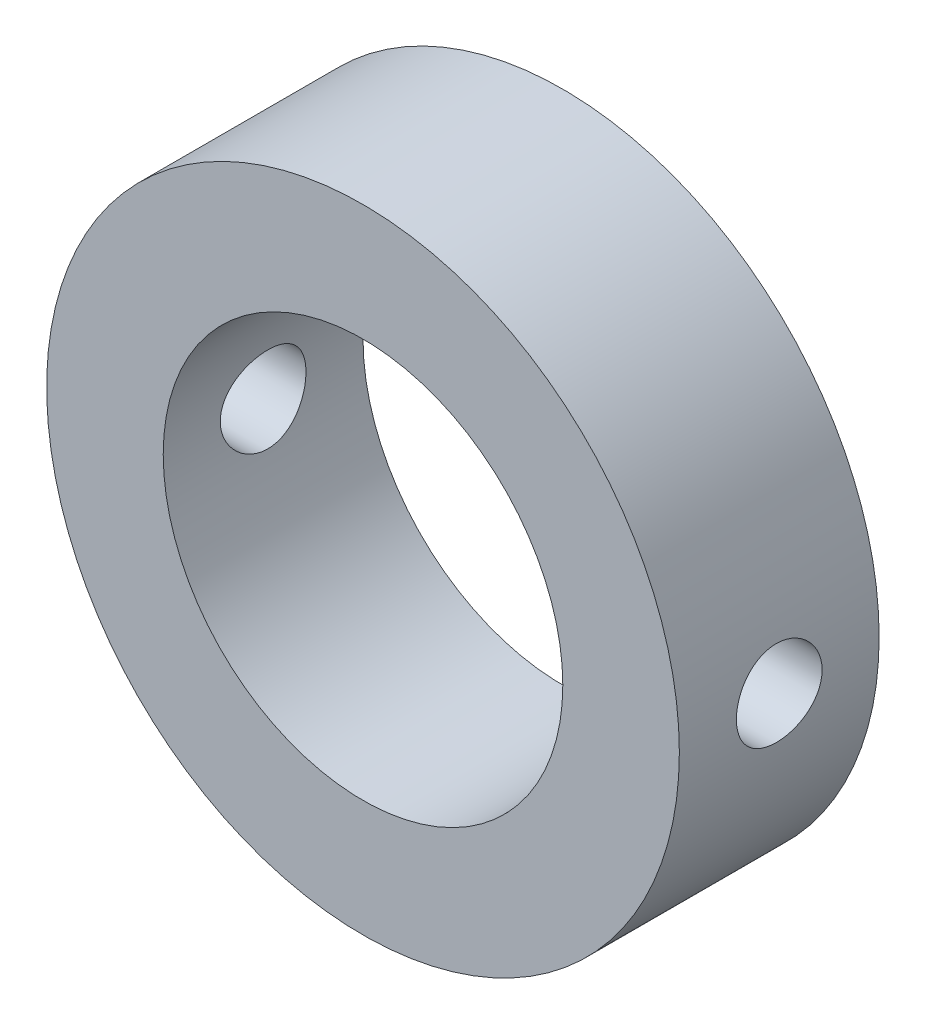
ISO-10303-21;
HEADER;
FILE_DESCRIPTION(('STEP AP214'),'2;1');
FILE_NAME('part.step','',(''),(''),'','','');
FILE_SCHEMA(('AUTOMOTIVE_DESIGN { 1 0 10303 214 1 1 1 1 }'));
ENDSEC;
DATA;
#1=APPLICATION_CONTEXT('core data for automotive mechanical design processes');
#2=APPLICATION_PROTOCOL_DEFINITION('international standard','automotive_design',2000,#1);
#3=PRODUCT_CONTEXT('',#1,'mechanical');
#4=PRODUCT('Part','Part','',(#3));
#5=PRODUCT_RELATED_PRODUCT_CATEGORY('part','',(#4));
#6=PRODUCT_DEFINITION_FORMATION('','',#4);
#7=PRODUCT_DEFINITION_CONTEXT('part definition',#1,'design');
#8=PRODUCT_DEFINITION('design','',#6,#7);
#9=PRODUCT_DEFINITION_SHAPE('','',#8);
#10=(LENGTH_UNIT() NAMED_UNIT(*) SI_UNIT(.MILLI.,.METRE.));
#11=(NAMED_UNIT(*) PLANE_ANGLE_UNIT() SI_UNIT($,.RADIAN.));
#12=(NAMED_UNIT(*) SI_UNIT($,.STERADIAN.) SOLID_ANGLE_UNIT());
#13=UNCERTAINTY_MEASURE_WITH_UNIT(LENGTH_MEASURE(1.E-05),#10,'distance_accuracy_value','');
#14=(GEOMETRIC_REPRESENTATION_CONTEXT(3) GLOBAL_UNCERTAINTY_ASSIGNED_CONTEXT((#13)) GLOBAL_UNIT_ASSIGNED_CONTEXT((#10,
#11,#12)) REPRESENTATION_CONTEXT('',''));
#15=CARTESIAN_POINT('',(0.,0.,0.));
#16=DIRECTION('',(0.,0.,1.));
#17=DIRECTION('',(1.,0.,0.));
#18=AXIS2_PLACEMENT_3D('',#15,#16,#17);
#19=CARTESIAN_POINT('',(0.,0.,6.));
#20=DIRECTION('',(0.,0.,1.));
#21=DIRECTION('',(1.,0.,0.));
#22=AXIS2_PLACEMENT_3D('',#19,#20,#21);
#23=PLANE('',#22);
#24=CARTESIAN_POINT('',(0.,0.,6.));
#25=DIRECTION('',(0.,0.,1.));
#26=DIRECTION('',(1.,0.,0.));
#27=AXIS2_PLACEMENT_3D('',#24,#25,#26);
#28=CIRCLE('',#27,19.);
#29=CARTESIAN_POINT('',(19.,0.,6.));
#30=VERTEX_POINT('',#29);
#31=EDGE_CURVE('E11',#30,#30,#28,.T.);
#32=ORIENTED_EDGE('',*,*,#31,.T.);
#33=EDGE_LOOP('',(#32));
#34=FACE_BOUND('',#33,.T.);
#35=CARTESIAN_POINT('',(0.,0.,6.));
#36=DIRECTION('',(0.,0.,1.));
#37=DIRECTION('',(1.,0.,0.));
#38=AXIS2_PLACEMENT_3D('',#35,#36,#37);
#39=CIRCLE('',#38,12.);
#40=CARTESIAN_POINT('',(12.,0.,6.));
#41=VERTEX_POINT('',#40);
#42=EDGE_CURVE('E55',#41,#41,#39,.T.);
#43=ORIENTED_EDGE('',*,*,#42,.F.);
#44=EDGE_LOOP('',(#43));
#45=FACE_BOUND('',#44,.T.);
#46=ADVANCED_FACE('F37',(#34,#45),#23,.T.);
#47=CARTESIAN_POINT('',(0.,0.,-6.));
#48=DIRECTION('',(0.,0.,1.));
#49=DIRECTION('',(1.,0.,0.));
#50=AXIS2_PLACEMENT_3D('',#47,#48,#49);
#51=PLANE('',#50);
#52=CARTESIAN_POINT('',(0.,0.,-6.));
#53=DIRECTION('',(0.,0.,1.));
#54=DIRECTION('',(1.,0.,0.));
#55=AXIS2_PLACEMENT_3D('',#52,#53,#54);
#56=CIRCLE('',#55,19.);
#57=CARTESIAN_POINT('',(19.,0.,-6.));
#58=VERTEX_POINT('',#57);
#59=EDGE_CURVE('E50',#58,#58,#56,.T.);
#60=ORIENTED_EDGE('',*,*,#59,.F.);
#61=EDGE_LOOP('',(#60));
#62=FACE_BOUND('',#61,.T.);
#63=CARTESIAN_POINT('',(0.,0.,-6.));
#64=DIRECTION('',(0.,0.,1.));
#65=DIRECTION('',(1.,0.,0.));
#66=AXIS2_PLACEMENT_3D('',#63,#64,#65);
#67=CIRCLE('',#66,12.);
#68=CARTESIAN_POINT('',(12.,0.,-6.));
#69=VERTEX_POINT('',#68);
#70=EDGE_CURVE('E58',#69,#69,#67,.T.);
#71=ORIENTED_EDGE('',*,*,#70,.T.);
#72=EDGE_LOOP('',(#71));
#73=FACE_BOUND('',#72,.T.);
#74=ADVANCED_FACE('F91',(#62,#73),#51,.F.);
#75=CARTESIAN_POINT('',(0.,0.,6.));
#76=DIRECTION('',(0.,0.,-1.));
#77=DIRECTION('',(-1.,0.,0.));
#78=AXIS2_PLACEMENT_3D('',#75,#76,#77);
#79=CYLINDRICAL_SURFACE('',#78,19.);
#80=CARTESIAN_POINT('',(-19.,0.,2.5748672517949));
#81=CARTESIAN_POINT('',(-18.9999978587735,-0.143923969748203,2.57486120413419));
#82=CARTESIAN_POINT('',(-18.9983474572848,-0.28793531915704,2.56275944983088));
#83=CARTESIAN_POINT('',(-18.9919224619895,-0.571943493597771,2.51467828472262));
#84=CARTESIAN_POINT('',(-18.9871446938618,-0.711936088669269,2.47867461260546));
#85=CARTESIAN_POINT('',(-18.9750026776924,-0.983754609274015,2.38387600762609));
#86=CARTESIAN_POINT('',(-18.9676402568268,-1.11558622682615,2.3250971722397));
#87=CARTESIAN_POINT('',(-18.9511456624555,-1.36749137987465,2.18645367592731));
#88=CARTESIAN_POINT('',(-18.9420137693904,-1.48756677406153,2.10659235560276));
#89=CARTESIAN_POINT('',(-18.9229325334773,-1.71334593087833,1.92750283151742));
#90=CARTESIAN_POINT('',(-18.9129787971465,-1.81896319562851,1.82816603625075));
#91=CARTESIAN_POINT('',(-18.8934107278206,-2.01208249813882,1.61317880986211));
#92=CARTESIAN_POINT('',(-18.8837964129998,-2.09958356709368,1.49752750684006));
#93=CARTESIAN_POINT('',(-18.8659528347985,-2.25431491658168,1.2526240831509));
#94=CARTESIAN_POINT('',(-18.8577292416595,-2.32146305525546,1.12331961598129));
#95=CARTESIAN_POINT('',(-18.8436570982998,-2.43305774829611,0.855138719761985));
#96=CARTESIAN_POINT('',(-18.837808442453,-2.47750531230144,0.716262716731018));
#97=CARTESIAN_POINT('',(-18.8291909182935,-2.542171874723,0.433783887354499));
#98=CARTESIAN_POINT('',(-18.8264033798546,-2.56253780910067,0.29021527805782));
#99=CARTESIAN_POINT('',(-18.8241667810873,-2.57891788010695,0.0016731484916192));
#100=CARTESIAN_POINT('',(-18.8247175636942,-2.57493316240916,-0.143300305360968));
#101=CARTESIAN_POINT('',(-18.8290782915061,-2.54284543942851,-0.429507306620112));
#102=CARTESIAN_POINT('',(-18.8328662681443,-2.51490500067209,-0.570759462505123));
#103=CARTESIAN_POINT('',(-18.8432402940148,-2.43595294004264,-0.846551762454316));
#104=CARTESIAN_POINT('',(-18.8498264089725,-2.38494077623625,-0.98109174877345));
#105=CARTESIAN_POINT('',(-18.8650792824393,-2.26112084637407,-1.2401414845771));
#106=CARTESIAN_POINT('',(-18.873752698595,-2.1882431507957,-1.36461740130712));
#107=CARTESIAN_POINT('',(-18.8921978979478,-2.02281082093172,-1.59963459623178));
#108=CARTESIAN_POINT('',(-18.901969740116,-1.93025512995681,-1.71017512560161));
#109=CARTESIAN_POINT('',(-18.9216081856101,-1.72719660335559,-1.91512674069767));
#110=CARTESIAN_POINT('',(-18.9314749127044,-1.61655378278395,-2.00939917796425));
#111=CARTESIAN_POINT('',(-18.9501171925647,-1.38094176822158,-2.17805659841931));
#112=CARTESIAN_POINT('',(-18.9588927420033,-1.2559725305467,-2.25244152096442));
#113=CARTESIAN_POINT('',(-18.9743707525648,-0.99514289013624,-2.3792152908875));
#114=CARTESIAN_POINT('',(-18.9810723194138,-0.859277820966149,-2.43159465322891));
#115=CARTESIAN_POINT('',(-18.991639462416,-0.580569371924114,-2.512756216085));
#116=CARTESIAN_POINT('',(-18.9955051947938,-0.437726376924526,-2.5415397164923));
#117=CARTESIAN_POINT('',(-18.9999446497919,-0.150314804578114,-2.57451093875323));
#118=CARTESIAN_POINT('',(-19.0005439145938,-0.00576849945893118,-2.57888950140809));
#119=CARTESIAN_POINT('',(-18.9984521026137,0.281996094586324,-2.56343135334194));
#120=CARTESIAN_POINT('',(-18.9957611085136,0.425214416792571,-2.54359525111885));
#121=CARTESIAN_POINT('',(-18.9874069892078,0.705688521492797,-2.48042946036537));
#122=CARTESIAN_POINT('',(-18.9817554786541,0.842965351061264,-2.43719155955738));
#123=CARTESIAN_POINT('',(-18.9681125627188,1.10832028867046,-2.32854550933412));
#124=CARTESIAN_POINT('',(-18.9601210654237,1.23639803513013,-2.26313648903354));
#125=CARTESIAN_POINT('',(-18.9426242958455,1.48056623833795,-2.1115487953933));
#126=CARTESIAN_POINT('',(-18.9331102120467,1.59658000256925,-2.02524762544825));
#127=CARTESIAN_POINT('',(-18.9136580480606,1.81254485252579,-1.83449759671461));
#128=CARTESIAN_POINT('',(-18.9037199479764,1.91249518342657,-1.73004788560153));
#129=CARTESIAN_POINT('',(-18.8844601454209,2.09417998691368,-1.50512142266927));
#130=CARTESIAN_POINT('',(-18.8751430401039,2.17578737433721,-1.38454156556202));
#131=CARTESIAN_POINT('',(-18.858258116911,2.31758965698397,-1.13127406995856));
#132=CARTESIAN_POINT('',(-18.8506902589106,2.37778504337557,-0.998586709283247));
#133=CARTESIAN_POINT('',(-18.8381928557696,2.47485233111111,-0.725268321381649));
#134=CARTESIAN_POINT('',(-18.8332554286458,2.51179397248245,-0.584662437866878));
#135=CARTESIAN_POINT('',(-18.8265559978761,2.56152874183622,-0.299171310144739));
#136=CARTESIAN_POINT('',(-18.8247938182955,2.5743232077726,-0.154286303488134));
#137=CARTESIAN_POINT('',(-18.8246501251889,2.57537297540954,0.134385131292231));
#138=CARTESIAN_POINT('',(-18.8262410987832,2.56382798400318,0.278170859926122));
#139=CARTESIAN_POINT('',(-18.832565043889,2.51695147836871,0.561737178020952));
#140=CARTESIAN_POINT('',(-18.8372980137826,2.48161997638933,0.701517769544274));
#141=CARTESIAN_POINT('',(-18.8493637118999,2.388239158248,0.97306799109805));
#142=CARTESIAN_POINT('',(-18.8566951387502,2.33020121254266,1.1048415926039));
#143=CARTESIAN_POINT('',(-18.8731335873505,2.19307462780149,1.35681255241822));
#144=CARTESIAN_POINT('',(-18.8822406466418,2.11398554367814,1.47700966589001));
#145=CARTESIAN_POINT('',(-18.9012935595498,1.93626667412728,1.7034342812611));
#146=CARTESIAN_POINT('',(-18.9112454369671,1.83748835563555,1.80954470426853));
#147=CARTESIAN_POINT('',(-18.9308146075773,1.6235073932625,2.00375752393124));
#148=CARTESIAN_POINT('',(-18.9404318218351,1.50830090679473,2.09185569571281));
#149=CARTESIAN_POINT('',(-18.9582962555726,1.26413670373261,2.24788572832148));
#150=CARTESIAN_POINT('',(-18.9665371680476,1.13511989999819,2.31572581545581));
#151=CARTESIAN_POINT('',(-18.9806576315467,0.867480160792979,2.42867704742829));
#152=CARTESIAN_POINT('',(-18.9865396993645,0.72886764979004,2.47381243044086));
#153=CARTESIAN_POINT('',(-18.9938916056808,0.491312154289936,2.52949268550329));
#154=CARTESIAN_POINT('',(-18.9961708550266,0.393855349203831,2.54648308387137));
#155=CARTESIAN_POINT('',(-18.9992257803905,0.197612754489461,2.56917239121501));
#156=CARTESIAN_POINT('',(-19.0000014702967,0.0988269771452289,2.57487140448766));
#157=CARTESIAN_POINT('',(-19.,0.,2.5748672517949));
#158=B_SPLINE_CURVE_WITH_KNOTS('',3,(#80,#81,#82,#83,#84,#85,#86,#87,#88,#89,#90,#91,#92,#93,
#94,#95,#96,#97,#98,#99,#100,#101,#102,#103,#104,#105,#106,#107,#108,#109,#110,#111,#112,#113,
#114,#115,#116,#117,#118,#119,#120,#121,#122,#123,#124,#125,#126,#127,#128,#129,#130,#131,#132,
#133,#134,#135,#136,#137,#138,#139,#140,#141,#142,#143,#144,#145,#146,#147,#148,#149,#150,#151,
#152,#153,#154,#155,#156,#157),.UNSPECIFIED.,.T.,.F.,(4,2,2,2,2,2,2,2,2,2,2,2,2,2,2,2,2,2,2,2,2,
2,2,2,2,2,2,2,2,2,2,2,2,2,2,2,2,2,4),(0.,0.431410870726488,0.863260310008801,1.2948050734381,
1.72628149792795,2.16023592623585,2.59421355526482,3.02992003110206,3.46560712662233,
3.89862189553513,4.3316162916971,4.76169538216481,5.19178457531527,5.62326419742605,
6.05476699542941,6.48978295825727,6.9248002475726,7.36000485009571,7.79518547564888,
8.22695826670017,8.65872020782072,9.0888008146694,9.51889831711462,9.95158142809168,
10.3842848650077,10.8198996305893,11.2555044029903,11.6897964547886,12.1240644424958,
12.5547831053274,12.9855015463631,13.4160045767518,13.8465167100569,14.2804086512464,
14.7144022477442,15.1503331030534,15.5857975919468,15.8820333486169,16.1782663689823),.UNSPECIFIED.);
#159=CARTESIAN_POINT('',(-19.,0.,2.5748672517949));
#160=VERTEX_POINT('',#159);
#161=EDGE_CURVE('E81',#160,#160,#158,.T.);
#162=ORIENTED_EDGE('',*,*,#161,.T.);
#163=EDGE_LOOP('',(#162));
#164=FACE_BOUND('',#163,.T.);
#165=CARTESIAN_POINT('',(19.,0.,-2.5748672517949));
#166=CARTESIAN_POINT('',(18.9999978587735,-0.143923969748203,-2.57486120413419));
#167=CARTESIAN_POINT('',(18.9983474572848,-0.28793531915704,-2.56275944983088));
#168=CARTESIAN_POINT('',(18.9919224619895,-0.571943493597771,-2.51467828472262));
#169=CARTESIAN_POINT('',(18.9871446938618,-0.711936088669269,-2.47867461260546));
#170=CARTESIAN_POINT('',(18.9750026776924,-0.983754609274015,-2.38387600762609));
#171=CARTESIAN_POINT('',(18.9676402568268,-1.11558622682615,-2.3250971722397));
#172=CARTESIAN_POINT('',(18.9511456624555,-1.36749137987465,-2.18645367592731));
#173=CARTESIAN_POINT('',(18.9420137693904,-1.48756677406153,-2.10659235560276));
#174=CARTESIAN_POINT('',(18.9229325334773,-1.71334593087833,-1.92750283151742));
#175=CARTESIAN_POINT('',(18.9129787971465,-1.81896319562851,-1.82816603625075));
#176=CARTESIAN_POINT('',(18.8934107278206,-2.01208249813882,-1.61317880986211));
#177=CARTESIAN_POINT('',(18.8837964129998,-2.09958356709368,-1.49752750684006));
#178=CARTESIAN_POINT('',(18.8659528347985,-2.25431491658168,-1.2526240831509));
#179=CARTESIAN_POINT('',(18.8577292416595,-2.32146305525546,-1.12331961598129));
#180=CARTESIAN_POINT('',(18.8436570982998,-2.43305774829611,-0.855138719761985));
#181=CARTESIAN_POINT('',(18.837808442453,-2.47750531230144,-0.716262716731018));
#182=CARTESIAN_POINT('',(18.8291909182935,-2.542171874723,-0.433783887354499));
#183=CARTESIAN_POINT('',(18.8264033798546,-2.56253780910067,-0.29021527805782));
#184=CARTESIAN_POINT('',(18.8241667810873,-2.57891788010695,-0.0016731484916192));
#185=CARTESIAN_POINT('',(18.8247175636942,-2.57493316240916,0.143300305360968));
#186=CARTESIAN_POINT('',(18.8290782915061,-2.54284543942851,0.429507306620112));
#187=CARTESIAN_POINT('',(18.8328662681443,-2.51490500067209,0.570759462505123));
#188=CARTESIAN_POINT('',(18.8432402940148,-2.43595294004264,0.846551762454316));
#189=CARTESIAN_POINT('',(18.8498264089725,-2.38494077623625,0.98109174877345));
#190=CARTESIAN_POINT('',(18.8650792824393,-2.26112084637407,1.2401414845771));
#191=CARTESIAN_POINT('',(18.873752698595,-2.1882431507957,1.36461740130712));
#192=CARTESIAN_POINT('',(18.8921978979478,-2.02281082093172,1.59963459623178));
#193=CARTESIAN_POINT('',(18.901969740116,-1.93025512995681,1.71017512560161));
#194=CARTESIAN_POINT('',(18.9216081856101,-1.72719660335559,1.91512674069767));
#195=CARTESIAN_POINT('',(18.9314749127044,-1.61655378278395,2.00939917796425));
#196=CARTESIAN_POINT('',(18.9501171925647,-1.38094176822158,2.17805659841931));
#197=CARTESIAN_POINT('',(18.9588927420033,-1.2559725305467,2.25244152096442));
#198=CARTESIAN_POINT('',(18.9743707525648,-0.99514289013624,2.3792152908875));
#199=CARTESIAN_POINT('',(18.9810723194138,-0.859277820966149,2.43159465322891));
#200=CARTESIAN_POINT('',(18.991639462416,-0.580569371924114,2.512756216085));
#201=CARTESIAN_POINT('',(18.9955051947938,-0.437726376924526,2.5415397164923));
#202=CARTESIAN_POINT('',(18.9999446497919,-0.150314804578114,2.57451093875323));
#203=CARTESIAN_POINT('',(19.0005439145938,-0.00576849945893118,2.57888950140809));
#204=CARTESIAN_POINT('',(18.9984521026137,0.281996094586324,2.56343135334194));
#205=CARTESIAN_POINT('',(18.9957611085136,0.425214416792571,2.54359525111885));
#206=CARTESIAN_POINT('',(18.9874069892078,0.705688521492797,2.48042946036537));
#207=CARTESIAN_POINT('',(18.9817554786541,0.842965351061264,2.43719155955738));
#208=CARTESIAN_POINT('',(18.9681125627188,1.10832028867046,2.32854550933412));
#209=CARTESIAN_POINT('',(18.9601210654237,1.23639803513013,2.26313648903354));
#210=CARTESIAN_POINT('',(18.9426242958455,1.48056623833795,2.1115487953933));
#211=CARTESIAN_POINT('',(18.9331102120467,1.59658000256925,2.02524762544825));
#212=CARTESIAN_POINT('',(18.9136580480606,1.81254485252579,1.83449759671461));
#213=CARTESIAN_POINT('',(18.9037199479764,1.91249518342657,1.73004788560153));
#214=CARTESIAN_POINT('',(18.8844601454209,2.09417998691368,1.50512142266927));
#215=CARTESIAN_POINT('',(18.8751430401039,2.17578737433721,1.38454156556202));
#216=CARTESIAN_POINT('',(18.858258116911,2.31758965698397,1.13127406995856));
#217=CARTESIAN_POINT('',(18.8506902589106,2.37778504337557,0.998586709283247));
#218=CARTESIAN_POINT('',(18.8381928557696,2.47485233111111,0.725268321381649));
#219=CARTESIAN_POINT('',(18.8332554286458,2.51179397248245,0.584662437866878));
#220=CARTESIAN_POINT('',(18.8265559978761,2.56152874183622,0.299171310144739));
#221=CARTESIAN_POINT('',(18.8247938182955,2.5743232077726,0.154286303488134));
#222=CARTESIAN_POINT('',(18.8246501251889,2.57537297540954,-0.134385131292231));
#223=CARTESIAN_POINT('',(18.8262410987832,2.56382798400318,-0.278170859926122));
#224=CARTESIAN_POINT('',(18.832565043889,2.51695147836871,-0.561737178020952));
#225=CARTESIAN_POINT('',(18.8372980137826,2.48161997638933,-0.701517769544274));
#226=CARTESIAN_POINT('',(18.8493637118999,2.388239158248,-0.97306799109805));
#227=CARTESIAN_POINT('',(18.8566951387502,2.33020121254266,-1.1048415926039));
#228=CARTESIAN_POINT('',(18.8731335873505,2.19307462780149,-1.35681255241822));
#229=CARTESIAN_POINT('',(18.8822406466418,2.11398554367814,-1.47700966589001));
#230=CARTESIAN_POINT('',(18.9012935595498,1.93626667412728,-1.7034342812611));
#231=CARTESIAN_POINT('',(18.9112454369671,1.83748835563555,-1.80954470426853));
#232=CARTESIAN_POINT('',(18.9308146075773,1.6235073932625,-2.00375752393124));
#233=CARTESIAN_POINT('',(18.9404318218351,1.50830090679473,-2.09185569571281));
#234=CARTESIAN_POINT('',(18.9582962555726,1.26413670373261,-2.24788572832148));
#235=CARTESIAN_POINT('',(18.9665371680476,1.13511989999819,-2.31572581545581));
#236=CARTESIAN_POINT('',(18.9806576315467,0.867480160792979,-2.42867704742829));
#237=CARTESIAN_POINT('',(18.9865396993645,0.72886764979004,-2.47381243044086));
#238=CARTESIAN_POINT('',(18.9938916056808,0.491312154289936,-2.52949268550329));
#239=CARTESIAN_POINT('',(18.9961708550266,0.393855349203831,-2.54648308387137));
#240=CARTESIAN_POINT('',(18.9992257803905,0.197612754489461,-2.56917239121501));
#241=CARTESIAN_POINT('',(19.0000014702967,0.0988269771452289,-2.57487140448766));
#242=CARTESIAN_POINT('',(19.,0.,-2.5748672517949));
#243=B_SPLINE_CURVE_WITH_KNOTS('',3,(#165,#166,#167,#168,#169,#170,#171,#172,#173,#174,#175,
#176,#177,#178,#179,#180,#181,#182,#183,#184,#185,#186,#187,#188,#189,#190,#191,#192,#193,#194,
#195,#196,#197,#198,#199,#200,#201,#202,#203,#204,#205,#206,#207,#208,#209,#210,#211,#212,#213,
#214,#215,#216,#217,#218,#219,#220,#221,#222,#223,#224,#225,#226,#227,#228,#229,#230,#231,#232,
#233,#234,#235,#236,#237,#238,#239,#240,#241,#242),.UNSPECIFIED.,.T.,.F.,(4,2,2,2,2,2,2,2,2,2,2,
2,2,2,2,2,2,2,2,2,2,2,2,2,2,2,2,2,2,2,2,2,2,2,2,2,2,2,4),(0.,0.431410870726488,
0.863260310008801,1.2948050734381,1.72628149792795,2.16023592623585,2.59421355526482,
3.02992003110206,3.46560712662233,3.89862189553513,4.3316162916971,4.76169538216481,
5.19178457531527,5.62326419742605,6.05476699542941,6.48978295825727,6.9248002475726,
7.36000485009571,7.79518547564888,8.22695826670017,8.65872020782072,9.0888008146694,
9.51889831711462,9.95158142809168,10.3842848650077,10.8198996305893,11.2555044029903,
11.6897964547886,12.1240644424958,12.5547831053274,12.9855015463631,13.4160045767518,
13.8465167100569,14.2804086512464,14.7144022477442,15.1503331030534,15.5857975919468,
15.8820333486169,16.1782663689823),.UNSPECIFIED.);
#244=CARTESIAN_POINT('',(19.,0.,-2.5748672517949));
#245=VERTEX_POINT('',#244);
#246=EDGE_CURVE('E77',#245,#245,#243,.T.);
#247=ORIENTED_EDGE('',*,*,#246,.T.);
#248=EDGE_LOOP('',(#247));
#249=FACE_BOUND('',#248,.T.);
#250=ORIENTED_EDGE('',*,*,#31,.F.);
#251=EDGE_LOOP('',(#250));
#252=FACE_BOUND('',#251,.T.);
#253=ORIENTED_EDGE('',*,*,#59,.T.);
#254=EDGE_LOOP('',(#253));
#255=FACE_BOUND('',#254,.T.);
#256=ADVANCED_FACE('F39',(#164,#249,#252,#255),#79,.T.);
#257=CARTESIAN_POINT('',(0.,0.,6.));
#258=DIRECTION('',(0.,0.,-1.));
#259=DIRECTION('',(-1.,0.,0.));
#260=AXIS2_PLACEMENT_3D('',#257,#258,#259);
#261=CYLINDRICAL_SURFACE('',#260,12.);
#262=CARTESIAN_POINT('',(-12.,0.,2.5748672517949));
#263=CARTESIAN_POINT('',(-11.9999973576132,-0.142876300092718,2.57486228075665));
#264=CARTESIAN_POINT('',(-11.9974223057735,-0.285813287746784,2.56293504237487));
#265=CARTESIAN_POINT('',(-11.9873985541302,-0.5676317219688,2.51558808042176));
#266=CARTESIAN_POINT('',(-11.979946282609,-0.706510118398592,2.4801511398103));
#267=CARTESIAN_POINT('',(-11.960998394885,-0.976097367421056,2.38694219533704));
#268=CARTESIAN_POINT('',(-11.9495069235768,-1.10681443358199,2.3291930814943));
#269=CARTESIAN_POINT('',(-11.9237229391836,-1.35669848886414,2.19307068105082));
#270=CARTESIAN_POINT('',(-11.9094305199667,-1.47586586485003,2.11469808557443));
#271=CARTESIAN_POINT('',(-11.8793647232776,-1.70111758230694,1.93826940528698));
#272=CARTESIAN_POINT('',(-11.8635735561595,-1.8069975629378,1.83995541522628));
#273=CARTESIAN_POINT('',(-11.8324162973609,-2.00089750850499,1.62698856798923));
#274=CARTESIAN_POINT('',(-11.8170502425584,-2.08891592814181,1.51233429858711));
#275=CARTESIAN_POINT('',(-11.788308016294,-2.2454886044116,1.26843988269888));
#276=CARTESIAN_POINT('',(-11.7749546626224,-2.3138266650117,1.13905801635895));
#277=CARTESIAN_POINT('',(-11.7520045026072,-2.42771237471952,0.870313276763276));
#278=CARTESIAN_POINT('',(-11.7424072652329,-2.47326263899366,0.730951550912614));
#279=CARTESIAN_POINT('',(-11.7282368897807,-2.53960708442058,0.448415828816712));
#280=CARTESIAN_POINT('',(-11.7235905503695,-2.5607623541706,0.305330371703388));
#281=CARTESIAN_POINT('',(-11.7196280906188,-2.57883878117809,0.0175715145571115));
#282=CARTESIAN_POINT('',(-11.7203113405836,-2.57576280137974,-0.127101695864395));
#283=CARTESIAN_POINT('',(-11.7268645345774,-2.54575493936893,-0.411254751793798));
#284=CARTESIAN_POINT('',(-11.7326435520999,-2.51924124804787,-0.550781173761041));
#285=CARTESIAN_POINT('',(-11.7485935080235,-2.44377257048763,-0.823358300549573));
#286=CARTESIAN_POINT('',(-11.7587646844886,-2.39481636781034,-0.95640865391989));
#287=CARTESIAN_POINT('',(-11.7824432928785,-2.27546487502224,-1.21343921714571));
#288=CARTESIAN_POINT('',(-11.795975772921,-2.20490765376292,-1.33734183120419));
#289=CARTESIAN_POINT('',(-11.8248366947276,-2.0444709328802,-1.57170390344844));
#290=CARTESIAN_POINT('',(-11.8401653724401,-1.95458889345321,-1.68216159161609));
#291=CARTESIAN_POINT('',(-11.8712825357975,-1.7558344546648,-1.88890724143933));
#292=CARTESIAN_POINT('',(-11.8870739560159,-1.64660614564281,-1.98485293441652));
#293=CARTESIAN_POINT('',(-11.9170467784548,-1.41343242655769,-2.15711874512395));
#294=CARTESIAN_POINT('',(-11.9312281535982,-1.28948676905499,-2.23343853281982));
#295=CARTESIAN_POINT('',(-11.9564263727783,-1.02998757014741,-2.36436575998347));
#296=CARTESIAN_POINT('',(-11.9674368594919,-0.894411406962982,-2.41892966403614));
#297=CARTESIAN_POINT('',(-11.9850052639049,-0.615726446162512,-2.5044075297754));
#298=CARTESIAN_POINT('',(-11.9915638041774,-0.472618704801419,-2.5353247983526));
#299=CARTESIAN_POINT('',(-11.9994011684263,-0.185869990108955,-2.57213698118983));
#300=CARTESIAN_POINT('',(-12.0007786717414,-0.0422916826120492,-2.5784996308797));
#301=CARTESIAN_POINT('',(-11.9983747228325,0.243876265552569,-2.56728788063934));
#302=CARTESIAN_POINT('',(-11.994593606685,0.386465970018063,-2.54971504007129));
#303=CARTESIAN_POINT('',(-11.9823594243175,0.665068704841843,-2.49151917849018));
#304=CARTESIAN_POINT('',(-11.9739558598016,0.801135091894016,-2.45114026649297));
#305=CARTESIAN_POINT('',(-11.9534168818104,1.06456415772794,-2.34874845806935));
#306=CARTESIAN_POINT('',(-11.9412811587772,1.19192611346295,-2.28673376703999));
#307=CARTESIAN_POINT('',(-11.9143799694977,1.43627392711793,-2.14184770152795));
#308=CARTESIAN_POINT('',(-11.8995804840801,1.55309209883753,-2.05869998248465));
#309=CARTESIAN_POINT('',(-11.869065127489,1.77128540712584,-1.87427340370954));
#310=CARTESIAN_POINT('',(-11.8533491422518,1.87265861578247,-1.77299228390887));
#311=CARTESIAN_POINT('',(-11.8224330974892,2.05892361201565,-1.55303130222843));
#312=CARTESIAN_POINT('',(-11.8072470825072,2.14349212518895,-1.43407535474948));
#313=CARTESIAN_POINT('',(-11.7794286896512,2.29145162124804,-1.18337367506738));
#314=CARTESIAN_POINT('',(-11.7667962028163,2.3548435078302,-1.05162848894497));
#315=CARTESIAN_POINT('',(-11.7456327944972,2.45823061585169,-0.779787259510075));
#316=CARTESIAN_POINT('',(-11.7370792047102,2.498355418853,-0.639742350067642));
#317=CARTESIAN_POINT('',(-11.7249994279397,2.5544523454728,-0.354691738449937));
#318=CARTESIAN_POINT('',(-11.7214724716679,2.57042816493313,-0.209686798848835));
#319=CARTESIAN_POINT('',(-11.7198924695804,2.57762096705793,0.0779115163956855));
#320=CARTESIAN_POINT('',(-11.7217261924789,2.56935009166561,0.220491701839235));
#321=CARTESIAN_POINT('',(-11.7304055608149,2.52942586751873,0.502176393161912));
#322=CARTESIAN_POINT('',(-11.7372511517318,2.49777277312275,0.641280936833064));
#323=CARTESIAN_POINT('',(-11.7551287630134,2.4122258089094,0.911677389455271));
#324=CARTESIAN_POINT('',(-11.7661472487044,2.35840379447291,1.0429929856439));
#325=CARTESIAN_POINT('',(-11.7911349655818,2.23010954813046,1.29480742569407));
#326=CARTESIAN_POINT('',(-11.8051044907194,2.15563525883278,1.41530519029293));
#327=CARTESIAN_POINT('',(-11.834760405598,1.98644026360959,1.64459405017665));
#328=CARTESIAN_POINT('',(-11.8504749375733,1.89135343701567,1.75311139192779));
#329=CARTESIAN_POINT('',(-11.8816582628121,1.6843777817891,1.95281787200235));
#330=CARTESIAN_POINT('',(-11.8971269985416,1.57248508162296,2.04400300654751));
#331=CARTESIAN_POINT('',(-11.9263027227159,1.3334051657184,2.20753442713808));
#332=CARTESIAN_POINT('',(-11.9399855256862,1.20604572830692,2.27963347113249));
#333=CARTESIAN_POINT('',(-11.9638062402357,0.940751731581262,2.40128803795205));
#334=CARTESIAN_POINT('',(-11.9739471744204,0.802826312388977,2.45086279376994));
#335=CARTESIAN_POINT('',(-11.9876950406406,0.553935077006438,2.51704943472531));
#336=CARTESIAN_POINT('',(-11.9922811849619,0.444332757011566,2.53869038009735));
#337=CARTESIAN_POINT('',(-11.9984346344108,0.223165912975828,2.56760093387267));
#338=CARTESIAN_POINT('',(-12.0000020639829,0.111601470013491,2.57487113470043));
#339=CARTESIAN_POINT('',(-12.,0.,2.5748672517949));
#340=B_SPLINE_CURVE_WITH_KNOTS('',3,(#262,#263,#264,#265,#266,#267,#268,#269,#270,#271,#272,
#273,#274,#275,#276,#277,#278,#279,#280,#281,#282,#283,#284,#285,#286,#287,#288,#289,#290,#291,
#292,#293,#294,#295,#296,#297,#298,#299,#300,#301,#302,#303,#304,#305,#306,#307,#308,#309,#310,
#311,#312,#313,#314,#315,#316,#317,#318,#319,#320,#321,#322,#323,#324,#325,#326,#327,#328,#329,
#330,#331,#332,#333,#334,#335,#336,#337,#338,#339),.UNSPECIFIED.,.T.,.F.,(4,2,2,2,2,2,2,2,2,2,2,
2,2,2,2,2,2,2,2,2,2,2,2,2,2,2,2,2,2,2,2,2,2,2,2,2,2,2,4),(0.,0.428220448688281,
0.856754846024156,1.28485077304524,1.71293235574476,2.14695075349604,2.58100668451502,
3.0196633266728,3.45826961629062,3.89029688357524,4.32227310721107,4.74669388254395,
5.17113766522466,5.59884459258421,6.02660776659685,6.46326271408366,6.89992500399449,
7.33745675976648,7.77492731721956,8.20402223301896,8.63308919524927,9.05764830303358,
9.48224263470548,9.91270374059526,10.3432185346963,10.7813490224011,11.2194608108328,
11.6551085858868,12.0906896811841,12.5171371046002,12.9435798890653,13.3686512018044,
13.7937648756184,14.2271593045145,14.6606537271358,15.0995156669738,15.538002164763,
15.8725013207977,16.2069866870371),.UNSPECIFIED.);
#341=CARTESIAN_POINT('',(-12.,0.,2.5748672517949));
#342=VERTEX_POINT('',#341);
#343=EDGE_CURVE('E42',#342,#342,#340,.T.);
#344=ORIENTED_EDGE('',*,*,#343,.F.);
#345=EDGE_LOOP('',(#344));
#346=FACE_BOUND('',#345,.T.);
#347=CARTESIAN_POINT('',(12.,0.,-2.5748672517949));
#348=CARTESIAN_POINT('',(11.9999973576132,-0.142876300092718,-2.57486228075665));
#349=CARTESIAN_POINT('',(11.9974223057735,-0.285813287746784,-2.56293504237487));
#350=CARTESIAN_POINT('',(11.9873985541302,-0.5676317219688,-2.51558808042176));
#351=CARTESIAN_POINT('',(11.979946282609,-0.706510118398592,-2.4801511398103));
#352=CARTESIAN_POINT('',(11.960998394885,-0.976097367421056,-2.38694219533704));
#353=CARTESIAN_POINT('',(11.9495069235768,-1.10681443358199,-2.3291930814943));
#354=CARTESIAN_POINT('',(11.9237229391836,-1.35669848886414,-2.19307068105082));
#355=CARTESIAN_POINT('',(11.9094305199667,-1.47586586485003,-2.11469808557443));
#356=CARTESIAN_POINT('',(11.8793647232776,-1.70111758230694,-1.93826940528698));
#357=CARTESIAN_POINT('',(11.8635735561595,-1.8069975629378,-1.83995541522628));
#358=CARTESIAN_POINT('',(11.8324162973609,-2.00089750850499,-1.62698856798923));
#359=CARTESIAN_POINT('',(11.8170502425584,-2.08891592814181,-1.51233429858711));
#360=CARTESIAN_POINT('',(11.788308016294,-2.2454886044116,-1.26843988269888));
#361=CARTESIAN_POINT('',(11.7749546626224,-2.3138266650117,-1.13905801635895));
#362=CARTESIAN_POINT('',(11.7520045026072,-2.42771237471952,-0.870313276763276));
#363=CARTESIAN_POINT('',(11.7424072652329,-2.47326263899366,-0.730951550912614));
#364=CARTESIAN_POINT('',(11.7282368897807,-2.53960708442058,-0.448415828816712));
#365=CARTESIAN_POINT('',(11.7235905503695,-2.5607623541706,-0.305330371703388));
#366=CARTESIAN_POINT('',(11.7196280906188,-2.57883878117809,-0.0175715145571115));
#367=CARTESIAN_POINT('',(11.7203113405836,-2.57576280137974,0.127101695864395));
#368=CARTESIAN_POINT('',(11.7268645345774,-2.54575493936893,0.411254751793798));
#369=CARTESIAN_POINT('',(11.7326435520999,-2.51924124804787,0.550781173761041));
#370=CARTESIAN_POINT('',(11.7485935080235,-2.44377257048763,0.823358300549573));
#371=CARTESIAN_POINT('',(11.7587646844886,-2.39481636781034,0.95640865391989));
#372=CARTESIAN_POINT('',(11.7824432928785,-2.27546487502224,1.21343921714571));
#373=CARTESIAN_POINT('',(11.795975772921,-2.20490765376292,1.33734183120419));
#374=CARTESIAN_POINT('',(11.8248366947276,-2.0444709328802,1.57170390344844));
#375=CARTESIAN_POINT('',(11.8401653724401,-1.95458889345321,1.68216159161609));
#376=CARTESIAN_POINT('',(11.8712825357975,-1.7558344546648,1.88890724143933));
#377=CARTESIAN_POINT('',(11.8870739560159,-1.64660614564281,1.98485293441652));
#378=CARTESIAN_POINT('',(11.9170467784548,-1.41343242655769,2.15711874512395));
#379=CARTESIAN_POINT('',(11.9312281535982,-1.28948676905499,2.23343853281982));
#380=CARTESIAN_POINT('',(11.9564263727783,-1.02998757014741,2.36436575998347));
#381=CARTESIAN_POINT('',(11.9674368594919,-0.894411406962982,2.41892966403614));
#382=CARTESIAN_POINT('',(11.9850052639049,-0.615726446162512,2.5044075297754));
#383=CARTESIAN_POINT('',(11.9915638041774,-0.472618704801419,2.5353247983526));
#384=CARTESIAN_POINT('',(11.9994011684263,-0.185869990108955,2.57213698118983));
#385=CARTESIAN_POINT('',(12.0007786717414,-0.0422916826120492,2.5784996308797));
#386=CARTESIAN_POINT('',(11.9983747228325,0.243876265552569,2.56728788063934));
#387=CARTESIAN_POINT('',(11.994593606685,0.386465970018063,2.54971504007129));
#388=CARTESIAN_POINT('',(11.9823594243175,0.665068704841843,2.49151917849018));
#389=CARTESIAN_POINT('',(11.9739558598016,0.801135091894016,2.45114026649297));
#390=CARTESIAN_POINT('',(11.9534168818104,1.06456415772794,2.34874845806935));
#391=CARTESIAN_POINT('',(11.9412811587772,1.19192611346295,2.28673376703999));
#392=CARTESIAN_POINT('',(11.9143799694977,1.43627392711793,2.14184770152795));
#393=CARTESIAN_POINT('',(11.8995804840801,1.55309209883753,2.05869998248465));
#394=CARTESIAN_POINT('',(11.869065127489,1.77128540712584,1.87427340370954));
#395=CARTESIAN_POINT('',(11.8533491422518,1.87265861578247,1.77299228390887));
#396=CARTESIAN_POINT('',(11.8224330974892,2.05892361201565,1.55303130222843));
#397=CARTESIAN_POINT('',(11.8072470825072,2.14349212518895,1.43407535474948));
#398=CARTESIAN_POINT('',(11.7794286896512,2.29145162124804,1.18337367506738));
#399=CARTESIAN_POINT('',(11.7667962028163,2.3548435078302,1.05162848894497));
#400=CARTESIAN_POINT('',(11.7456327944972,2.45823061585169,0.779787259510075));
#401=CARTESIAN_POINT('',(11.7370792047102,2.498355418853,0.639742350067642));
#402=CARTESIAN_POINT('',(11.7249994279397,2.5544523454728,0.354691738449937));
#403=CARTESIAN_POINT('',(11.7214724716679,2.57042816493313,0.209686798848835));
#404=CARTESIAN_POINT('',(11.7198924695804,2.57762096705793,-0.0779115163956855));
#405=CARTESIAN_POINT('',(11.7217261924789,2.56935009166561,-0.220491701839235));
#406=CARTESIAN_POINT('',(11.7304055608149,2.52942586751873,-0.502176393161912));
#407=CARTESIAN_POINT('',(11.7372511517318,2.49777277312275,-0.641280936833064));
#408=CARTESIAN_POINT('',(11.7551287630134,2.4122258089094,-0.911677389455271));
#409=CARTESIAN_POINT('',(11.7661472487044,2.35840379447291,-1.0429929856439));
#410=CARTESIAN_POINT('',(11.7911349655818,2.23010954813046,-1.29480742569407));
#411=CARTESIAN_POINT('',(11.8051044907194,2.15563525883278,-1.41530519029293));
#412=CARTESIAN_POINT('',(11.834760405598,1.98644026360959,-1.64459405017665));
#413=CARTESIAN_POINT('',(11.8504749375733,1.89135343701567,-1.75311139192779));
#414=CARTESIAN_POINT('',(11.8816582628121,1.6843777817891,-1.95281787200235));
#415=CARTESIAN_POINT('',(11.8971269985416,1.57248508162296,-2.04400300654751));
#416=CARTESIAN_POINT('',(11.9263027227159,1.3334051657184,-2.20753442713808));
#417=CARTESIAN_POINT('',(11.9399855256862,1.20604572830692,-2.27963347113249));
#418=CARTESIAN_POINT('',(11.9638062402357,0.940751731581262,-2.40128803795205));
#419=CARTESIAN_POINT('',(11.9739471744204,0.802826312388977,-2.45086279376994));
#420=CARTESIAN_POINT('',(11.9876950406406,0.553935077006438,-2.51704943472531));
#421=CARTESIAN_POINT('',(11.9922811849619,0.444332757011566,-2.53869038009735));
#422=CARTESIAN_POINT('',(11.9984346344108,0.223165912975828,-2.56760093387267));
#423=CARTESIAN_POINT('',(12.0000020639829,0.111601470013491,-2.57487113470043));
#424=CARTESIAN_POINT('',(12.,0.,-2.5748672517949));
#425=B_SPLINE_CURVE_WITH_KNOTS('',3,(#347,#348,#349,#350,#351,#352,#353,#354,#355,#356,#357,
#358,#359,#360,#361,#362,#363,#364,#365,#366,#367,#368,#369,#370,#371,#372,#373,#374,#375,#376,
#377,#378,#379,#380,#381,#382,#383,#384,#385,#386,#387,#388,#389,#390,#391,#392,#393,#394,#395,
#396,#397,#398,#399,#400,#401,#402,#403,#404,#405,#406,#407,#408,#409,#410,#411,#412,#413,#414,
#415,#416,#417,#418,#419,#420,#421,#422,#423,#424),.UNSPECIFIED.,.T.,.F.,(4,2,2,2,2,2,2,2,2,2,2,
2,2,2,2,2,2,2,2,2,2,2,2,2,2,2,2,2,2,2,2,2,2,2,2,2,2,2,4),(0.,0.428220448688281,
0.856754846024156,1.28485077304524,1.71293235574476,2.14695075349604,2.58100668451502,
3.0196633266728,3.45826961629062,3.89029688357524,4.32227310721107,4.74669388254395,
5.17113766522466,5.59884459258421,6.02660776659685,6.46326271408366,6.89992500399449,
7.33745675976648,7.77492731721956,8.20402223301896,8.63308919524927,9.05764830303358,
9.48224263470548,9.91270374059526,10.3432185346963,10.7813490224011,11.2194608108328,
11.6551085858868,12.0906896811841,12.5171371046002,12.9435798890653,13.3686512018044,
13.7937648756184,14.2271593045145,14.6606537271358,15.0995156669738,15.538002164763,
15.8725013207977,16.2069866870371),.UNSPECIFIED.);
#426=CARTESIAN_POINT('',(12.,0.,-2.5748672517949));
#427=VERTEX_POINT('',#426);
#428=EDGE_CURVE('E60',#427,#427,#425,.T.);
#429=ORIENTED_EDGE('',*,*,#428,.F.);
#430=EDGE_LOOP('',(#429));
#431=FACE_BOUND('',#430,.T.);
#432=ORIENTED_EDGE('',*,*,#42,.T.);
#433=EDGE_LOOP('',(#432));
#434=FACE_BOUND('',#433,.T.);
#435=ORIENTED_EDGE('',*,*,#70,.F.);
#436=EDGE_LOOP('',(#435));
#437=FACE_BOUND('',#436,.T.);
#438=ADVANCED_FACE('F64',(#346,#431,#434,#437),#261,.F.);
#439=CARTESIAN_POINT('',(-36.,0.,0.));
#440=DIRECTION('',(1.,0.,0.));
#441=DIRECTION('',(0.,0.,-1.));
#442=AXIS2_PLACEMENT_3D('',#439,#440,#441);
#443=CYLINDRICAL_SURFACE('',#442,2.5748672517949);
#444=ORIENTED_EDGE('',*,*,#428,.T.);
#445=EDGE_LOOP('',(#444));
#446=FACE_BOUND('',#445,.T.);
#447=ORIENTED_EDGE('',*,*,#246,.F.);
#448=EDGE_LOOP('',(#447));
#449=FACE_BOUND('',#448,.T.);
#450=ADVANCED_FACE('F70',(#446,#449),#443,.F.);
#451=ORIENTED_EDGE('',*,*,#343,.T.);
#452=EDGE_LOOP('',(#451));
#453=FACE_BOUND('',#452,.T.);
#454=ORIENTED_EDGE('',*,*,#161,.F.);
#455=EDGE_LOOP('',(#454));
#456=FACE_BOUND('',#455,.T.);
#457=ADVANCED_FACE('F67',(#453,#456),#443,.F.);
#458=CLOSED_SHELL('',(#46,#74,#256,#438,#450,#457));
#459=MANIFOLD_SOLID_BREP('B2',#458);
#460=ADVANCED_BREP_SHAPE_REPRESENTATION('',(#18,#459),#14);
#461=SHAPE_DEFINITION_REPRESENTATION(#9,#460);
ENDSEC;
END-ISO-10303-21;
